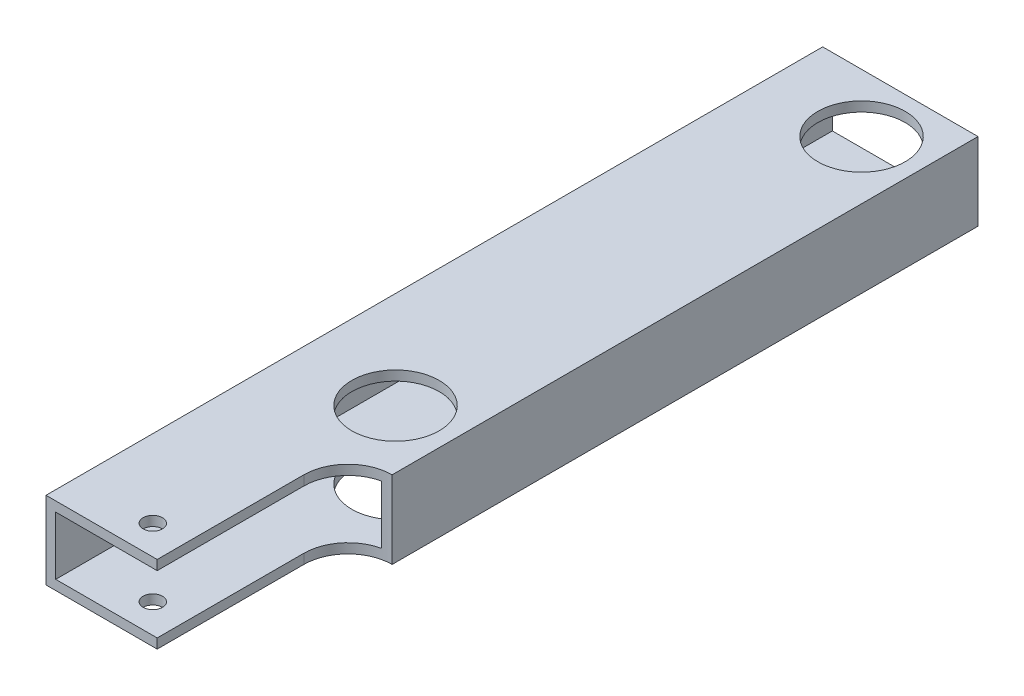
ISO-10303-21;
HEADER;
FILE_DESCRIPTION(('STEP AP214'),'2;1');
FILE_NAME('part.step','',(''),(''),'','','');
FILE_SCHEMA(('AUTOMOTIVE_DESIGN { 1 0 10303 214 1 1 1 1 }'));
ENDSEC;
DATA;
#1=APPLICATION_CONTEXT('core data for automotive mechanical design processes');
#2=APPLICATION_PROTOCOL_DEFINITION('international standard','automotive_design',2000,#1);
#3=PRODUCT_CONTEXT('',#1,'mechanical');
#4=PRODUCT('Part','Part','',(#3));
#5=PRODUCT_RELATED_PRODUCT_CATEGORY('part','',(#4));
#6=PRODUCT_DEFINITION_FORMATION('','',#4);
#7=PRODUCT_DEFINITION_CONTEXT('part definition',#1,'design');
#8=PRODUCT_DEFINITION('design','',#6,#7);
#9=PRODUCT_DEFINITION_SHAPE('','',#8);
#10=(LENGTH_UNIT() NAMED_UNIT(*) SI_UNIT(.MILLI.,.METRE.));
#11=(NAMED_UNIT(*) PLANE_ANGLE_UNIT() SI_UNIT($,.RADIAN.));
#12=(NAMED_UNIT(*) SI_UNIT($,.STERADIAN.) SOLID_ANGLE_UNIT());
#13=UNCERTAINTY_MEASURE_WITH_UNIT(LENGTH_MEASURE(1.E-05),#10,'distance_accuracy_value','');
#14=(GEOMETRIC_REPRESENTATION_CONTEXT(3) GLOBAL_UNCERTAINTY_ASSIGNED_CONTEXT((#13)) GLOBAL_UNIT_ASSIGNED_CONTEXT((#10,
#11,#12)) REPRESENTATION_CONTEXT('',''));
#15=CARTESIAN_POINT('',(0.,0.,0.));
#16=DIRECTION('',(0.,0.,1.));
#17=DIRECTION('',(1.,0.,0.));
#18=AXIS2_PLACEMENT_3D('',#15,#16,#17);
#19=CARTESIAN_POINT('',(0.,0.,254.));
#20=DIRECTION('',(0.,0.,-1.));
#21=DIRECTION('',(-1.,0.,0.));
#22=AXIS2_PLACEMENT_3D('',#19,#20,#21);
#23=PLANE('',#22);
#24=DIRECTION('',(1.,0.,0.));
#25=VECTOR('',#24,1.);
#26=CARTESIAN_POINT('',(0.,0.,254.));
#27=LINE('',#26,#25);
#28=CARTESIAN_POINT('',(0.,0.,254.));
#29=VERTEX_POINT('',#28);
#30=CARTESIAN_POINT('',(36.3588553276486,0.,254.));
#31=VERTEX_POINT('',#30);
#32=EDGE_CURVE('E219',#29,#31,#27,.T.);
#33=ORIENTED_EDGE('',*,*,#32,.T.);
#34=DIRECTION('',(0.,1.,0.));
#35=VECTOR('',#34,1.);
#36=CARTESIAN_POINT('',(36.3588553276486,0.,254.));
#37=LINE('',#36,#35);
#38=CARTESIAN_POINT('',(36.3588553276486,3.175,254.));
#39=VERTEX_POINT('',#38);
#40=EDGE_CURVE('E199',#31,#39,#37,.T.);
#41=ORIENTED_EDGE('',*,*,#40,.T.);
#42=DIRECTION('',(1.,0.,0.));
#43=VECTOR('',#42,1.);
#44=CARTESIAN_POINT('',(3.175,3.175,254.));
#45=LINE('',#44,#43);
#46=CARTESIAN_POINT('',(3.175,3.175,254.));
#47=VERTEX_POINT('',#46);
#48=EDGE_CURVE('E287',#47,#39,#45,.T.);
#49=ORIENTED_EDGE('',*,*,#48,.F.);
#50=DIRECTION('',(0.,-1.,0.));
#51=VECTOR('',#50,1.);
#52=CARTESIAN_POINT('',(3.175,3.175,254.));
#53=LINE('',#52,#51);
#54=CARTESIAN_POINT('',(3.175,22.225,254.));
#55=VERTEX_POINT('',#54);
#56=EDGE_CURVE('E285',#55,#47,#53,.T.);
#57=ORIENTED_EDGE('',*,*,#56,.F.);
#58=DIRECTION('',(-1.,0.,0.));
#59=VECTOR('',#58,1.);
#60=CARTESIAN_POINT('',(3.175,22.225,254.));
#61=LINE('',#60,#59);
#62=CARTESIAN_POINT('',(36.3588553276486,22.225,254.));
#63=VERTEX_POINT('',#62);
#64=EDGE_CURVE('E210',#63,#55,#61,.T.);
#65=ORIENTED_EDGE('',*,*,#64,.F.);
#66=CARTESIAN_POINT('',(36.3588553276486,25.4,254.));
#67=VERTEX_POINT('',#66);
#68=EDGE_CURVE('E246',#63,#67,#37,.T.);
#69=ORIENTED_EDGE('',*,*,#68,.T.);
#70=DIRECTION('',(-1.,0.,0.));
#71=VECTOR('',#70,1.);
#72=CARTESIAN_POINT('',(0.,25.4,254.));
#73=LINE('',#72,#71);
#74=CARTESIAN_POINT('',(0.,25.4,254.));
#75=VERTEX_POINT('',#74);
#76=EDGE_CURVE('E223',#67,#75,#73,.T.);
#77=ORIENTED_EDGE('',*,*,#76,.T.);
#78=DIRECTION('',(0.,-1.,0.));
#79=VECTOR('',#78,1.);
#80=CARTESIAN_POINT('',(0.,0.,254.));
#81=LINE('',#80,#79);
#82=EDGE_CURVE('E216',#75,#29,#81,.T.);
#83=ORIENTED_EDGE('',*,*,#82,.T.);
#84=EDGE_LOOP('',(#33,#41,#49,#57,#65,#69,#77,#83));
#85=FACE_BOUND('',#84,.T.);
#86=ADVANCED_FACE('F39',(#85),#23,.F.);
#87=CARTESIAN_POINT('',(0.,0.,0.));
#88=DIRECTION('',(0.,0.,-1.));
#89=DIRECTION('',(-1.,0.,0.));
#90=AXIS2_PLACEMENT_3D('',#87,#88,#89);
#91=PLANE('',#90);
#92=DIRECTION('',(0.,-1.,0.));
#93=VECTOR('',#92,1.);
#94=CARTESIAN_POINT('',(0.,0.,0.));
#95=LINE('',#94,#93);
#96=CARTESIAN_POINT('',(0.,25.4,0.));
#97=VERTEX_POINT('',#96);
#98=CARTESIAN_POINT('',(0.,0.,0.));
#99=VERTEX_POINT('',#98);
#100=EDGE_CURVE('E215',#97,#99,#95,.T.);
#101=ORIENTED_EDGE('',*,*,#100,.F.);
#102=DIRECTION('',(-1.,0.,0.));
#103=VECTOR('',#102,1.);
#104=CARTESIAN_POINT('',(0.,25.4,0.));
#105=LINE('',#104,#103);
#106=CARTESIAN_POINT('',(50.8,25.4,0.));
#107=VERTEX_POINT('',#106);
#108=EDGE_CURVE('E220',#107,#97,#105,.T.);
#109=ORIENTED_EDGE('',*,*,#108,.F.);
#110=DIRECTION('',(0.,1.,0.));
#111=VECTOR('',#110,1.);
#112=CARTESIAN_POINT('',(50.8,0.,0.));
#113=LINE('',#112,#111);
#114=CARTESIAN_POINT('',(50.8,0.,0.));
#115=VERTEX_POINT('',#114);
#116=EDGE_CURVE('E228',#115,#107,#113,.T.);
#117=ORIENTED_EDGE('',*,*,#116,.F.);
#118=DIRECTION('',(1.,0.,0.));
#119=VECTOR('',#118,1.);
#120=CARTESIAN_POINT('',(0.,0.,0.));
#121=LINE('',#120,#119);
#122=EDGE_CURVE('E155',#99,#115,#121,.T.);
#123=ORIENTED_EDGE('',*,*,#122,.F.);
#124=EDGE_LOOP('',(#101,#109,#117,#123));
#125=FACE_BOUND('',#124,.T.);
#126=DIRECTION('',(-1.,0.,0.));
#127=VECTOR('',#126,1.);
#128=CARTESIAN_POINT('',(3.175,22.225,0.));
#129=LINE('',#128,#127);
#130=CARTESIAN_POINT('',(47.625,22.225,0.));
#131=VERTEX_POINT('',#130);
#132=CARTESIAN_POINT('',(3.175,22.225,0.));
#133=VERTEX_POINT('',#132);
#134=EDGE_CURVE('E204',#131,#133,#129,.T.);
#135=ORIENTED_EDGE('',*,*,#134,.T.);
#136=DIRECTION('',(0.,-1.,0.));
#137=VECTOR('',#136,1.);
#138=CARTESIAN_POINT('',(3.175,3.175,0.));
#139=LINE('',#138,#137);
#140=CARTESIAN_POINT('',(3.175,3.175,0.));
#141=VERTEX_POINT('',#140);
#142=EDGE_CURVE('E61',#133,#141,#139,.T.);
#143=ORIENTED_EDGE('',*,*,#142,.T.);
#144=DIRECTION('',(1.,0.,0.));
#145=VECTOR('',#144,1.);
#146=CARTESIAN_POINT('',(3.175,3.175,0.));
#147=LINE('',#146,#145);
#148=CARTESIAN_POINT('',(47.625,3.175,0.));
#149=VERTEX_POINT('',#148);
#150=EDGE_CURVE('E292',#141,#149,#147,.T.);
#151=ORIENTED_EDGE('',*,*,#150,.T.);
#152=DIRECTION('',(0.,1.,0.));
#153=VECTOR('',#152,1.);
#154=CARTESIAN_POINT('',(47.625,3.175,0.));
#155=LINE('',#154,#153);
#156=EDGE_CURVE('E295',#149,#131,#155,.T.);
#157=ORIENTED_EDGE('',*,*,#156,.T.);
#158=EDGE_LOOP('',(#135,#143,#151,#157));
#159=FACE_BOUND('',#158,.T.);
#160=ADVANCED_FACE('F240',(#125,#159),#91,.T.);
#161=CARTESIAN_POINT('',(0.,0.,254.));
#162=DIRECTION('',(1.,0.,0.));
#163=DIRECTION('',(0.,0.,-1.));
#164=AXIS2_PLACEMENT_3D('',#161,#162,#163);
#165=PLANE('',#164);
#166=ORIENTED_EDGE('',*,*,#100,.T.);
#167=DIRECTION('',(0.,0.,-1.));
#168=VECTOR('',#167,1.);
#169=CARTESIAN_POINT('',(0.,0.,254.));
#170=LINE('',#169,#168);
#171=EDGE_CURVE('E158',#29,#99,#170,.T.);
#172=ORIENTED_EDGE('',*,*,#171,.F.);
#173=ORIENTED_EDGE('',*,*,#82,.F.);
#174=DIRECTION('',(0.,0.,-1.));
#175=VECTOR('',#174,1.);
#176=CARTESIAN_POINT('',(0.,25.4,254.));
#177=LINE('',#176,#175);
#178=EDGE_CURVE('E164',#75,#97,#177,.T.);
#179=ORIENTED_EDGE('',*,*,#178,.T.);
#180=EDGE_LOOP('',(#166,#172,#173,#179));
#181=FACE_BOUND('',#180,.T.);
#182=ADVANCED_FACE('F41',(#181),#165,.F.);
#183=CARTESIAN_POINT('',(0.,0.,254.));
#184=DIRECTION('',(0.,1.,0.));
#185=DIRECTION('',(0.,0.,1.));
#186=AXIS2_PLACEMENT_3D('',#183,#184,#185);
#187=PLANE('',#186);
#188=CARTESIAN_POINT('',(25.4,0.,244.475));
#189=DIRECTION('',(0.,1.,0.));
#190=DIRECTION('',(0.,0.,1.));
#191=AXIS2_PLACEMENT_3D('',#188,#189,#190);
#192=CIRCLE('',#191,3.17499999999998);
#193=CARTESIAN_POINT('',(25.4,0.,247.65));
#194=VERTEX_POINT('',#193);
#195=EDGE_CURVE('E180',#194,#194,#192,.T.);
#196=ORIENTED_EDGE('',*,*,#195,.T.);
#197=EDGE_LOOP('',(#196));
#198=FACE_BOUND('',#197,.T.);
#199=CARTESIAN_POINT('',(31.75,0.,19.05));
#200=DIRECTION('',(0.,1.,0.));
#201=DIRECTION('',(0.,0.,1.));
#202=AXIS2_PLACEMENT_3D('',#199,#200,#201);
#203=CIRCLE('',#202,14.2875);
#204=CARTESIAN_POINT('',(31.75,0.,33.3375));
#205=VERTEX_POINT('',#204);
#206=EDGE_CURVE('E172',#205,#205,#203,.T.);
#207=ORIENTED_EDGE('',*,*,#206,.T.);
#208=EDGE_LOOP('',(#207));
#209=FACE_BOUND('',#208,.T.);
#210=CARTESIAN_POINT('',(31.75,0.,171.45));
#211=DIRECTION('',(0.,1.,0.));
#212=DIRECTION('',(0.,0.,1.));
#213=AXIS2_PLACEMENT_3D('',#210,#211,#212);
#214=CIRCLE('',#213,14.2875);
#215=CARTESIAN_POINT('',(31.75,0.,185.7375));
#216=VERTEX_POINT('',#215);
#217=EDGE_CURVE('E275',#216,#216,#214,.T.);
#218=ORIENTED_EDGE('',*,*,#217,.T.);
#219=EDGE_LOOP('',(#218));
#220=FACE_BOUND('',#219,.T.);
#221=CARTESIAN_POINT('',(50.8,0.,206.035443664803));
#222=DIRECTION('',(0.,1.,0.));
#223=DIRECTION('',(0.,0.,1.));
#224=AXIS2_PLACEMENT_3D('',#221,#222,#223);
#225=CIRCLE('',#224,14.4411446723514);
#226=CARTESIAN_POINT('',(50.8,0.,191.594298992451));
#227=VERTEX_POINT('',#226);
#228=CARTESIAN_POINT('',(36.3588553276486,0.,206.035443664803));
#229=VERTEX_POINT('',#228);
#230=EDGE_CURVE('E130',#227,#229,#225,.T.);
#231=ORIENTED_EDGE('',*,*,#230,.T.);
#232=DIRECTION('',(0.,0.,1.));
#233=VECTOR('',#232,1.);
#234=CARTESIAN_POINT('',(36.3588553276486,0.,254.));
#235=LINE('',#234,#233);
#236=EDGE_CURVE('E141',#229,#31,#235,.T.);
#237=ORIENTED_EDGE('',*,*,#236,.T.);
#238=ORIENTED_EDGE('',*,*,#32,.F.);
#239=ORIENTED_EDGE('',*,*,#171,.T.);
#240=ORIENTED_EDGE('',*,*,#122,.T.);
#241=DIRECTION('',(0.,0.,-1.));
#242=VECTOR('',#241,1.);
#243=CARTESIAN_POINT('',(50.8,0.,254.));
#244=LINE('',#243,#242);
#245=EDGE_CURVE('E148',#227,#115,#244,.T.);
#246=ORIENTED_EDGE('',*,*,#245,.F.);
#247=EDGE_LOOP('',(#231,#237,#238,#239,#240,#246));
#248=FACE_BOUND('',#247,.T.);
#249=ADVANCED_FACE('F153',(#198,#209,#220,#248),#187,.F.);
#250=CARTESIAN_POINT('',(50.8,0.,254.));
#251=DIRECTION('',(-1.,0.,0.));
#252=DIRECTION('',(0.,0.,1.));
#253=AXIS2_PLACEMENT_3D('',#250,#251,#252);
#254=PLANE('',#253);
#255=DIRECTION('',(0.,0.,-1.));
#256=VECTOR('',#255,1.);
#257=CARTESIAN_POINT('',(50.8,25.4,254.));
#258=LINE('',#257,#256);
#259=CARTESIAN_POINT('',(50.8,25.4,191.594298992451));
#260=VERTEX_POINT('',#259);
#261=EDGE_CURVE('E150',#260,#107,#258,.T.);
#262=ORIENTED_EDGE('',*,*,#261,.F.);
#263=DIRECTION('',(0.,1.,0.));
#264=VECTOR('',#263,1.);
#265=CARTESIAN_POINT('',(50.8,0.,191.594298992451));
#266=LINE('',#265,#264);
#267=EDGE_CURVE('E133',#227,#260,#266,.T.);
#268=ORIENTED_EDGE('',*,*,#267,.F.);
#269=ORIENTED_EDGE('',*,*,#245,.T.);
#270=ORIENTED_EDGE('',*,*,#116,.T.);
#271=EDGE_LOOP('',(#262,#268,#269,#270));
#272=FACE_BOUND('',#271,.T.);
#273=ADVANCED_FACE('F146',(#272),#254,.F.);
#274=CARTESIAN_POINT('',(0.,25.4,254.));
#275=DIRECTION('',(0.,-1.,0.));
#276=DIRECTION('',(0.,0.,-1.));
#277=AXIS2_PLACEMENT_3D('',#274,#275,#276);
#278=PLANE('',#277);
#279=CARTESIAN_POINT('',(25.4,25.4,244.475));
#280=DIRECTION('',(0.,1.,0.));
#281=DIRECTION('',(0.,0.,1.));
#282=AXIS2_PLACEMENT_3D('',#279,#280,#281);
#283=CIRCLE('',#282,3.17499999999998);
#284=CARTESIAN_POINT('',(25.4,25.4,247.65));
#285=VERTEX_POINT('',#284);
#286=EDGE_CURVE('E262',#285,#285,#283,.T.);
#287=ORIENTED_EDGE('',*,*,#286,.F.);
#288=EDGE_LOOP('',(#287));
#289=FACE_BOUND('',#288,.T.);
#290=CARTESIAN_POINT('',(31.75,25.4,19.05));
#291=DIRECTION('',(0.,1.,0.));
#292=DIRECTION('',(0.,0.,1.));
#293=AXIS2_PLACEMENT_3D('',#290,#291,#292);
#294=CIRCLE('',#293,14.2875);
#295=CARTESIAN_POINT('',(31.75,25.4,33.3375));
#296=VERTEX_POINT('',#295);
#297=EDGE_CURVE('E272',#296,#296,#294,.T.);
#298=ORIENTED_EDGE('',*,*,#297,.F.);
#299=EDGE_LOOP('',(#298));
#300=FACE_BOUND('',#299,.T.);
#301=CARTESIAN_POINT('',(31.75,25.4,171.45));
#302=DIRECTION('',(0.,1.,0.));
#303=DIRECTION('',(0.,0.,1.));
#304=AXIS2_PLACEMENT_3D('',#301,#302,#303);
#305=CIRCLE('',#304,14.2875);
#306=CARTESIAN_POINT('',(31.75,25.4,185.7375));
#307=VERTEX_POINT('',#306);
#308=EDGE_CURVE('E269',#307,#307,#305,.T.);
#309=ORIENTED_EDGE('',*,*,#308,.F.);
#310=EDGE_LOOP('',(#309));
#311=FACE_BOUND('',#310,.T.);
#312=ORIENTED_EDGE('',*,*,#76,.F.);
#313=DIRECTION('',(0.,0.,1.));
#314=VECTOR('',#313,1.);
#315=CARTESIAN_POINT('',(36.3588553276486,25.4,254.));
#316=LINE('',#315,#314);
#317=CARTESIAN_POINT('',(36.3588553276486,25.4,206.035443664803));
#318=VERTEX_POINT('',#317);
#319=EDGE_CURVE('E142',#318,#67,#316,.T.);
#320=ORIENTED_EDGE('',*,*,#319,.F.);
#321=CARTESIAN_POINT('',(50.8,25.4,206.035443664803));
#322=DIRECTION('',(0.,1.,0.));
#323=DIRECTION('',(0.,0.,1.));
#324=AXIS2_PLACEMENT_3D('',#321,#322,#323);
#325=CIRCLE('',#324,14.4411446723514);
#326=EDGE_CURVE('E249',#260,#318,#325,.T.);
#327=ORIENTED_EDGE('',*,*,#326,.F.);
#328=ORIENTED_EDGE('',*,*,#261,.T.);
#329=ORIENTED_EDGE('',*,*,#108,.T.);
#330=ORIENTED_EDGE('',*,*,#178,.F.);
#331=EDGE_LOOP('',(#312,#320,#327,#328,#329,#330));
#332=FACE_BOUND('',#331,.T.);
#333=ADVANCED_FACE('F248',(#289,#300,#311,#332),#278,.F.);
#334=CARTESIAN_POINT('',(3.175,3.175,254.));
#335=DIRECTION('',(1.,0.,0.));
#336=DIRECTION('',(0.,0.,-1.));
#337=AXIS2_PLACEMENT_3D('',#334,#335,#336);
#338=PLANE('',#337);
#339=ORIENTED_EDGE('',*,*,#142,.F.);
#340=DIRECTION('',(0.,0.,-1.));
#341=VECTOR('',#340,1.);
#342=CARTESIAN_POINT('',(3.175,22.225,254.));
#343=LINE('',#342,#341);
#344=EDGE_CURVE('E206',#55,#133,#343,.T.);
#345=ORIENTED_EDGE('',*,*,#344,.F.);
#346=ORIENTED_EDGE('',*,*,#56,.T.);
#347=DIRECTION('',(0.,0.,-1.));
#348=VECTOR('',#347,1.);
#349=CARTESIAN_POINT('',(3.175,3.175,254.));
#350=LINE('',#349,#348);
#351=EDGE_CURVE('E208',#47,#141,#350,.T.);
#352=ORIENTED_EDGE('',*,*,#351,.T.);
#353=EDGE_LOOP('',(#339,#345,#346,#352));
#354=FACE_BOUND('',#353,.T.);
#355=ADVANCED_FACE('F302',(#354),#338,.T.);
#356=CARTESIAN_POINT('',(3.175,3.175,254.));
#357=DIRECTION('',(0.,1.,0.));
#358=DIRECTION('',(0.,0.,1.));
#359=AXIS2_PLACEMENT_3D('',#356,#357,#358);
#360=PLANE('',#359);
#361=DIRECTION('',(0.,0.,1.));
#362=VECTOR('',#361,1.);
#363=CARTESIAN_POINT('',(36.3588553276486,3.175,254.));
#364=LINE('',#363,#362);
#365=CARTESIAN_POINT('',(36.3588553276486,3.175,206.035443664803));
#366=VERTEX_POINT('',#365);
#367=EDGE_CURVE('E260',#366,#39,#364,.T.);
#368=ORIENTED_EDGE('',*,*,#367,.F.);
#369=CARTESIAN_POINT('',(50.8,3.175,206.035443664803));
#370=DIRECTION('',(0.,1.,0.));
#371=DIRECTION('',(0.,0.,1.));
#372=AXIS2_PLACEMENT_3D('',#369,#370,#371);
#373=CIRCLE('',#372,14.4411446723514);
#374=CARTESIAN_POINT('',(47.625,3.175,191.947646305109));
#375=VERTEX_POINT('',#374);
#376=EDGE_CURVE('E198',#375,#366,#373,.T.);
#377=ORIENTED_EDGE('',*,*,#376,.F.);
#378=DIRECTION('',(0.,0.,-1.));
#379=VECTOR('',#378,1.);
#380=CARTESIAN_POINT('',(47.625,3.175,254.));
#381=LINE('',#380,#379);
#382=EDGE_CURVE('E196',#375,#149,#381,.T.);
#383=ORIENTED_EDGE('',*,*,#382,.T.);
#384=ORIENTED_EDGE('',*,*,#150,.F.);
#385=ORIENTED_EDGE('',*,*,#351,.F.);
#386=ORIENTED_EDGE('',*,*,#48,.T.);
#387=EDGE_LOOP('',(#368,#377,#383,#384,#385,#386));
#388=FACE_BOUND('',#387,.T.);
#389=CARTESIAN_POINT('',(25.4,3.175,244.475));
#390=DIRECTION('',(0.,1.,0.));
#391=DIRECTION('',(0.,0.,1.));
#392=AXIS2_PLACEMENT_3D('',#389,#390,#391);
#393=CIRCLE('',#392,3.17499999999998);
#394=CARTESIAN_POINT('',(25.4,3.175,247.65));
#395=VERTEX_POINT('',#394);
#396=EDGE_CURVE('E179',#395,#395,#393,.T.);
#397=ORIENTED_EDGE('',*,*,#396,.F.);
#398=EDGE_LOOP('',(#397));
#399=FACE_BOUND('',#398,.T.);
#400=CARTESIAN_POINT('',(31.75,3.175,19.05));
#401=DIRECTION('',(0.,1.,0.));
#402=DIRECTION('',(0.,0.,1.));
#403=AXIS2_PLACEMENT_3D('',#400,#401,#402);
#404=CIRCLE('',#403,14.2875);
#405=CARTESIAN_POINT('',(31.75,3.175,33.3375));
#406=VERTEX_POINT('',#405);
#407=EDGE_CURVE('E176',#406,#406,#404,.T.);
#408=ORIENTED_EDGE('',*,*,#407,.F.);
#409=EDGE_LOOP('',(#408));
#410=FACE_BOUND('',#409,.T.);
#411=CARTESIAN_POINT('',(31.75,3.175,171.45));
#412=DIRECTION('',(0.,1.,0.));
#413=DIRECTION('',(0.,0.,1.));
#414=AXIS2_PLACEMENT_3D('',#411,#412,#413);
#415=CIRCLE('',#414,14.2875);
#416=CARTESIAN_POINT('',(31.75,3.175,185.7375));
#417=VERTEX_POINT('',#416);
#418=EDGE_CURVE('E171',#417,#417,#415,.T.);
#419=ORIENTED_EDGE('',*,*,#418,.F.);
#420=EDGE_LOOP('',(#419));
#421=FACE_BOUND('',#420,.T.);
#422=ADVANCED_FACE('F299',(#388,#399,#410,#421),#360,.T.);
#423=CARTESIAN_POINT('',(47.625,3.175,254.));
#424=DIRECTION('',(-1.,0.,0.));
#425=DIRECTION('',(0.,0.,1.));
#426=AXIS2_PLACEMENT_3D('',#423,#424,#425);
#427=PLANE('',#426);
#428=DIRECTION('',(0.,1.,0.));
#429=VECTOR('',#428,1.);
#430=CARTESIAN_POINT('',(47.625,0.,191.947646305109));
#431=LINE('',#430,#429);
#432=CARTESIAN_POINT('',(47.625,22.225,191.947646305109));
#433=VERTEX_POINT('',#432);
#434=EDGE_CURVE('E185',#433,#375,#431,.F.);
#435=ORIENTED_EDGE('',*,*,#434,.F.);
#436=DIRECTION('',(0.,0.,-1.));
#437=VECTOR('',#436,1.);
#438=CARTESIAN_POINT('',(47.625,22.225,254.));
#439=LINE('',#438,#437);
#440=EDGE_CURVE('E194',#433,#131,#439,.T.);
#441=ORIENTED_EDGE('',*,*,#440,.T.);
#442=ORIENTED_EDGE('',*,*,#156,.F.);
#443=ORIENTED_EDGE('',*,*,#382,.F.);
#444=EDGE_LOOP('',(#435,#441,#442,#443));
#445=FACE_BOUND('',#444,.T.);
#446=ADVANCED_FACE('F192',(#445),#427,.T.);
#447=CARTESIAN_POINT('',(3.175,22.225,254.));
#448=DIRECTION('',(0.,-1.,0.));
#449=DIRECTION('',(0.,0.,-1.));
#450=AXIS2_PLACEMENT_3D('',#447,#448,#449);
#451=PLANE('',#450);
#452=DIRECTION('',(0.,0.,-1.));
#453=VECTOR('',#452,1.);
#454=CARTESIAN_POINT('',(36.3588553276486,22.225,254.));
#455=LINE('',#454,#453);
#456=CARTESIAN_POINT('',(36.3588553276486,22.225,206.035443664803));
#457=VERTEX_POINT('',#456);
#458=EDGE_CURVE('E11',#63,#457,#455,.T.);
#459=ORIENTED_EDGE('',*,*,#458,.F.);
#460=ORIENTED_EDGE('',*,*,#64,.T.);
#461=ORIENTED_EDGE('',*,*,#344,.T.);
#462=ORIENTED_EDGE('',*,*,#134,.F.);
#463=ORIENTED_EDGE('',*,*,#440,.F.);
#464=CARTESIAN_POINT('',(50.8,22.225,206.035443664803));
#465=DIRECTION('',(0.,-1.,0.));
#466=DIRECTION('',(0.,0.,-1.));
#467=AXIS2_PLACEMENT_3D('',#464,#465,#466);
#468=CIRCLE('',#467,14.4411446723514);
#469=EDGE_CURVE('E47',#457,#433,#468,.T.);
#470=ORIENTED_EDGE('',*,*,#469,.F.);
#471=EDGE_LOOP('',(#459,#460,#461,#462,#463,#470));
#472=FACE_BOUND('',#471,.T.);
#473=CARTESIAN_POINT('',(25.4,22.225,244.475));
#474=DIRECTION('',(0.,-1.,0.));
#475=DIRECTION('',(0.,0.,-1.));
#476=AXIS2_PLACEMENT_3D('',#473,#474,#475);
#477=CIRCLE('',#476,3.17499999999998);
#478=CARTESIAN_POINT('',(25.4,22.225,241.3));
#479=VERTEX_POINT('',#478);
#480=EDGE_CURVE('E177',#479,#479,#477,.T.);
#481=ORIENTED_EDGE('',*,*,#480,.F.);
#482=EDGE_LOOP('',(#481));
#483=FACE_BOUND('',#482,.T.);
#484=CARTESIAN_POINT('',(31.75,22.225,19.05));
#485=DIRECTION('',(0.,-1.,0.));
#486=DIRECTION('',(0.,0.,-1.));
#487=AXIS2_PLACEMENT_3D('',#484,#485,#486);
#488=CIRCLE('',#487,14.2875);
#489=CARTESIAN_POINT('',(31.75,22.225,4.7625));
#490=VERTEX_POINT('',#489);
#491=EDGE_CURVE('E173',#490,#490,#488,.T.);
#492=ORIENTED_EDGE('',*,*,#491,.F.);
#493=EDGE_LOOP('',(#492));
#494=FACE_BOUND('',#493,.T.);
#495=CARTESIAN_POINT('',(31.75,22.225,171.45));
#496=DIRECTION('',(0.,-1.,0.));
#497=DIRECTION('',(0.,0.,-1.));
#498=AXIS2_PLACEMENT_3D('',#495,#496,#497);
#499=CIRCLE('',#498,14.2875);
#500=CARTESIAN_POINT('',(31.75,22.225,157.1625));
#501=VERTEX_POINT('',#500);
#502=EDGE_CURVE('E168',#501,#501,#499,.T.);
#503=ORIENTED_EDGE('',*,*,#502,.F.);
#504=EDGE_LOOP('',(#503));
#505=FACE_BOUND('',#504,.T.);
#506=ADVANCED_FACE('F201',(#472,#483,#494,#505),#451,.T.);
#507=CARTESIAN_POINT('',(31.75,0.,171.45));
#508=DIRECTION('',(0.,1.,0.));
#509=DIRECTION('',(0.,0.,1.));
#510=AXIS2_PLACEMENT_3D('',#507,#508,#509);
#511=CYLINDRICAL_SURFACE('',#510,14.2875);
#512=ORIENTED_EDGE('',*,*,#502,.T.);
#513=EDGE_LOOP('',(#512));
#514=FACE_BOUND('',#513,.T.);
#515=ORIENTED_EDGE('',*,*,#308,.T.);
#516=EDGE_LOOP('',(#515));
#517=FACE_BOUND('',#516,.T.);
#518=ADVANCED_FACE('F349',(#514,#517),#511,.F.);
#519=CARTESIAN_POINT('',(31.75,0.,19.05));
#520=DIRECTION('',(0.,1.,0.));
#521=DIRECTION('',(0.,0.,1.));
#522=AXIS2_PLACEMENT_3D('',#519,#520,#521);
#523=CYLINDRICAL_SURFACE('',#522,14.2875);
#524=ORIENTED_EDGE('',*,*,#491,.T.);
#525=EDGE_LOOP('',(#524));
#526=FACE_BOUND('',#525,.T.);
#527=ORIENTED_EDGE('',*,*,#297,.T.);
#528=EDGE_LOOP('',(#527));
#529=FACE_BOUND('',#528,.T.);
#530=ADVANCED_FACE('F346',(#526,#529),#523,.F.);
#531=ORIENTED_EDGE('',*,*,#418,.T.);
#532=EDGE_LOOP('',(#531));
#533=FACE_BOUND('',#532,.T.);
#534=ORIENTED_EDGE('',*,*,#217,.F.);
#535=EDGE_LOOP('',(#534));
#536=FACE_BOUND('',#535,.T.);
#537=ADVANCED_FACE('F343',(#533,#536),#511,.F.);
#538=ORIENTED_EDGE('',*,*,#407,.T.);
#539=EDGE_LOOP('',(#538));
#540=FACE_BOUND('',#539,.T.);
#541=ORIENTED_EDGE('',*,*,#206,.F.);
#542=EDGE_LOOP('',(#541));
#543=FACE_BOUND('',#542,.T.);
#544=ADVANCED_FACE('F345',(#540,#543),#523,.F.);
#545=CARTESIAN_POINT('',(25.4,0.,244.475));
#546=DIRECTION('',(0.,1.,0.));
#547=DIRECTION('',(0.,0.,1.));
#548=AXIS2_PLACEMENT_3D('',#545,#546,#547);
#549=CYLINDRICAL_SURFACE('',#548,3.17499999999998);
#550=ORIENTED_EDGE('',*,*,#480,.T.);
#551=EDGE_LOOP('',(#550));
#552=FACE_BOUND('',#551,.T.);
#553=ORIENTED_EDGE('',*,*,#286,.T.);
#554=EDGE_LOOP('',(#553));
#555=FACE_BOUND('',#554,.T.);
#556=ADVANCED_FACE('F314',(#552,#555),#549,.F.);
#557=ORIENTED_EDGE('',*,*,#396,.T.);
#558=EDGE_LOOP('',(#557));
#559=FACE_BOUND('',#558,.T.);
#560=ORIENTED_EDGE('',*,*,#195,.F.);
#561=EDGE_LOOP('',(#560));
#562=FACE_BOUND('',#561,.T.);
#563=ADVANCED_FACE('F308',(#559,#562),#549,.F.);
#564=CARTESIAN_POINT('',(36.3588553276486,0.,254.));
#565=DIRECTION('',(-1.,0.,0.));
#566=DIRECTION('',(0.,0.,1.));
#567=AXIS2_PLACEMENT_3D('',#564,#565,#566);
#568=PLANE('',#567);
#569=ORIENTED_EDGE('',*,*,#367,.T.);
#570=ORIENTED_EDGE('',*,*,#40,.F.);
#571=ORIENTED_EDGE('',*,*,#236,.F.);
#572=DIRECTION('',(0.,1.,0.));
#573=VECTOR('',#572,1.);
#574=CARTESIAN_POINT('',(36.3588553276486,0.,206.035443664803));
#575=LINE('',#574,#573);
#576=EDGE_CURVE('E136',#229,#366,#575,.T.);
#577=ORIENTED_EDGE('',*,*,#576,.T.);
#578=EDGE_LOOP('',(#569,#570,#571,#577));
#579=FACE_BOUND('',#578,.T.);
#580=ADVANCED_FACE('F305',(#579),#568,.F.);
#581=ORIENTED_EDGE('',*,*,#458,.T.);
#582=EDGE_CURVE('E54',#457,#318,#575,.T.);
#583=ORIENTED_EDGE('',*,*,#582,.T.);
#584=ORIENTED_EDGE('',*,*,#319,.T.);
#585=ORIENTED_EDGE('',*,*,#68,.F.);
#586=EDGE_LOOP('',(#581,#583,#584,#585));
#587=FACE_BOUND('',#586,.T.);
#588=ADVANCED_FACE('F307',(#587),#568,.F.);
#589=CARTESIAN_POINT('',(50.8,0.,206.035443664803));
#590=DIRECTION('',(0.,1.,0.));
#591=DIRECTION('',(0.,0.,1.));
#592=AXIS2_PLACEMENT_3D('',#589,#590,#591);
#593=CYLINDRICAL_SURFACE('',#592,14.4411446723514);
#594=ORIENTED_EDGE('',*,*,#376,.T.);
#595=ORIENTED_EDGE('',*,*,#576,.F.);
#596=ORIENTED_EDGE('',*,*,#230,.F.);
#597=ORIENTED_EDGE('',*,*,#267,.T.);
#598=ORIENTED_EDGE('',*,*,#326,.T.);
#599=ORIENTED_EDGE('',*,*,#582,.F.);
#600=ORIENTED_EDGE('',*,*,#469,.T.);
#601=ORIENTED_EDGE('',*,*,#434,.T.);
#602=EDGE_LOOP('',(#594,#595,#596,#597,#598,#599,#600,#601));
#603=FACE_BOUND('',#602,.T.);
#604=ADVANCED_FACE('F132',(#603),#593,.F.);
#605=CLOSED_SHELL('',(#86,#160,#182,#249,#273,#333,#355,#422,#446,#506,#518,#530,#537,#544,#556,
#563,#580,#588,#604));
#606=MANIFOLD_SOLID_BREP('B2',#605);
#607=ADVANCED_BREP_SHAPE_REPRESENTATION('',(#18,#606),#14);
#608=SHAPE_DEFINITION_REPRESENTATION(#9,#607);
ENDSEC;
END-ISO-10303-21;
